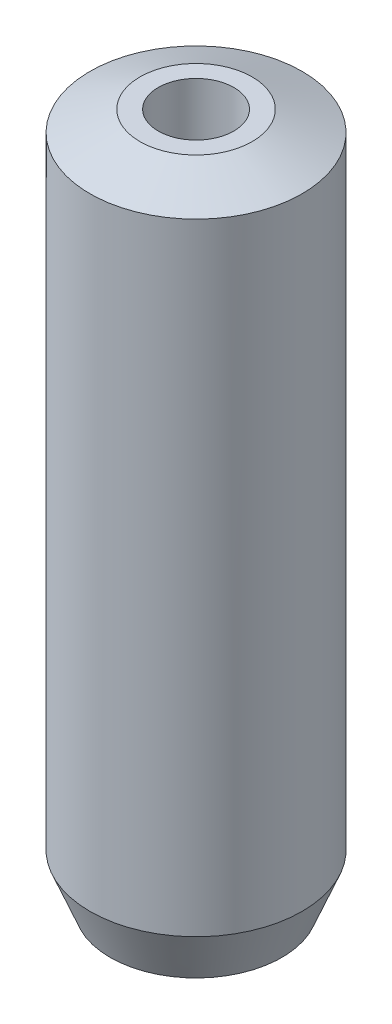
ISO-10303-21;
HEADER;
FILE_DESCRIPTION(('STEP AP214'),'2;1');
FILE_NAME('part.step','',(''),(''),'','','');
FILE_SCHEMA(('AUTOMOTIVE_DESIGN { 1 0 10303 214 1 1 1 1 }'));
ENDSEC;
DATA;
#1=APPLICATION_CONTEXT('core data for automotive mechanical design processes');
#2=APPLICATION_PROTOCOL_DEFINITION('international standard','automotive_design',2000,#1);
#3=PRODUCT_CONTEXT('',#1,'mechanical');
#4=PRODUCT('Part','Part','',(#3));
#5=PRODUCT_RELATED_PRODUCT_CATEGORY('part','',(#4));
#6=PRODUCT_DEFINITION_FORMATION('','',#4);
#7=PRODUCT_DEFINITION_CONTEXT('part definition',#1,'design');
#8=PRODUCT_DEFINITION('design','',#6,#7);
#9=PRODUCT_DEFINITION_SHAPE('','',#8);
#10=(LENGTH_UNIT() NAMED_UNIT(*) SI_UNIT(.MILLI.,.METRE.));
#11=(NAMED_UNIT(*) PLANE_ANGLE_UNIT() SI_UNIT($,.RADIAN.));
#12=(NAMED_UNIT(*) SI_UNIT($,.STERADIAN.) SOLID_ANGLE_UNIT());
#13=UNCERTAINTY_MEASURE_WITH_UNIT(LENGTH_MEASURE(1.E-05),#10,'distance_accuracy_value','');
#14=(GEOMETRIC_REPRESENTATION_CONTEXT(3) GLOBAL_UNCERTAINTY_ASSIGNED_CONTEXT((#13)) GLOBAL_UNIT_ASSIGNED_CONTEXT((#10,
#11,#12)) REPRESENTATION_CONTEXT('',''));
#15=CARTESIAN_POINT('',(0.,0.,0.));
#16=DIRECTION('',(0.,0.,1.));
#17=DIRECTION('',(1.,0.,0.));
#18=AXIS2_PLACEMENT_3D('',#15,#16,#17);
#19=CARTESIAN_POINT('',(0.,195.601865288086,0.));
#20=DIRECTION('',(0.,-1.,0.));
#21=DIRECTION('',(0.,0.,-1.));
#22=AXIS2_PLACEMENT_3D('',#19,#20,#21);
#23=CYLINDRICAL_SURFACE('',#22,30.);
#24=CARTESIAN_POINT('',(0.,189.899442802333,0.));
#25=DIRECTION('',(0.,1.,0.));
#26=DIRECTION('',(0.,0.,1.));
#27=AXIS2_PLACEMENT_3D('',#24,#25,#26);
#28=CIRCLE('',#27,30.);
#29=CARTESIAN_POINT('',(0.,189.899442802333,-30.));
#30=VERTEX_POINT('',#29);
#31=EDGE_CURVE('E50',#30,#30,#28,.F.);
#32=CARTESIAN_POINT('',(0.,14.1375035635513,0.));
#33=DIRECTION('',(0.,1.,0.));
#34=DIRECTION('',(0.,0.,1.));
#35=AXIS2_PLACEMENT_3D('',#32,#33,#34);
#36=CIRCLE('',#35,30.);
#37=CARTESIAN_POINT('',(0.,14.1375035635513,-30.));
#38=VERTEX_POINT('',#37);
#39=EDGE_CURVE('E51',#38,#38,#36,.T.);
#40=CARTESIAN_POINT('',(0.,189.899442802333,-30.));
#41=CARTESIAN_POINT('',(0.,188.068589268596,-30.));
#42=CARTESIAN_POINT('',(0.,186.237735734859,-30.));
#43=CARTESIAN_POINT('',(0.,182.576028667384,-30.));
#44=CARTESIAN_POINT('',(0.,180.745175133647,-30.));
#45=CARTESIAN_POINT('',(0.,177.083468066172,-30.));
#46=CARTESIAN_POINT('',(0.,175.252614532435,-30.));
#47=CARTESIAN_POINT('',(0.,171.59090746496,-30.));
#48=CARTESIAN_POINT('',(0.,169.760053931223,-30.));
#49=CARTESIAN_POINT('',(0.,166.098346863748,-30.));
#50=CARTESIAN_POINT('',(0.,164.267493330011,-30.));
#51=CARTESIAN_POINT('',(0.,160.605786262536,-30.));
#52=CARTESIAN_POINT('',(0.,158.774932728799,-30.));
#53=CARTESIAN_POINT('',(0.,155.113225661324,-30.));
#54=CARTESIAN_POINT('',(0.,153.282372127587,-30.));
#55=CARTESIAN_POINT('',(0.,149.620665060112,-30.));
#56=CARTESIAN_POINT('',(0.,147.789811526375,-30.));
#57=CARTESIAN_POINT('',(0.,144.1281044589,-30.));
#58=CARTESIAN_POINT('',(0.,142.297250925163,-30.));
#59=CARTESIAN_POINT('',(0.,138.635543857689,-30.));
#60=CARTESIAN_POINT('',(0.,136.804690323951,-30.));
#61=CARTESIAN_POINT('',(0.,133.142983256477,-30.));
#62=CARTESIAN_POINT('',(0.,131.312129722739,-30.));
#63=CARTESIAN_POINT('',(0.,127.650422655265,-30.));
#64=CARTESIAN_POINT('',(0.,125.819569121527,-30.));
#65=CARTESIAN_POINT('',(0.,122.157862054053,-30.));
#66=CARTESIAN_POINT('',(0.,120.327008520315,-30.));
#67=CARTESIAN_POINT('',(0.,116.665301452841,-30.));
#68=CARTESIAN_POINT('',(0.,114.834447919103,-30.));
#69=CARTESIAN_POINT('',(0.,111.172740851629,-30.));
#70=CARTESIAN_POINT('',(0.,109.341887317892,-30.));
#71=CARTESIAN_POINT('',(0.,105.680180250417,-30.));
#72=CARTESIAN_POINT('',(0.,103.84932671668,-30.));
#73=CARTESIAN_POINT('',(0.,100.187619649205,-30.));
#74=CARTESIAN_POINT('',(0.,98.3567661154677,-30.));
#75=CARTESIAN_POINT('',(0.,94.6950590479931,-30.));
#76=CARTESIAN_POINT('',(0.,92.8642055142557,-30.));
#77=CARTESIAN_POINT('',(0.,89.2024984467811,-30.));
#78=CARTESIAN_POINT('',(0.,87.3716449130438,-30.));
#79=CARTESIAN_POINT('',(0.,83.7099378455692,-30.));
#80=CARTESIAN_POINT('',(0.,81.8790843118318,-30.));
#81=CARTESIAN_POINT('',(0.,78.2173772443572,-30.));
#82=CARTESIAN_POINT('',(0.,76.3865237106199,-30.));
#83=CARTESIAN_POINT('',(0.,72.7248166431453,-30.));
#84=CARTESIAN_POINT('',(0.,70.893963109408,-30.));
#85=CARTESIAN_POINT('',(0.,67.2322560419334,-30.));
#86=CARTESIAN_POINT('',(0.,65.401402508196,-30.));
#87=CARTESIAN_POINT('',(0.,61.7396954407214,-30.));
#88=CARTESIAN_POINT('',(0.,59.9088419069841,-30.));
#89=CARTESIAN_POINT('',(0.,56.2471348395095,-30.));
#90=CARTESIAN_POINT('',(0.,54.4162813057722,-30.));
#91=CARTESIAN_POINT('',(0.,50.7545742382975,-30.));
#92=CARTESIAN_POINT('',(0.,48.9237207045602,-30.));
#93=CARTESIAN_POINT('',(0.,45.2620136370856,-30.));
#94=CARTESIAN_POINT('',(0.,43.4311601033483,-30.));
#95=CARTESIAN_POINT('',(0.,39.7694530358736,-30.));
#96=CARTESIAN_POINT('',(0.,37.9385995021363,-30.));
#97=CARTESIAN_POINT('',(0.,34.2768924346617,-30.));
#98=CARTESIAN_POINT('',(0.,32.4460389009244,-30.));
#99=CARTESIAN_POINT('',(0.,28.7843318334498,-30.));
#100=CARTESIAN_POINT('',(0.,26.9534782997124,-30.));
#101=CARTESIAN_POINT('',(0.,23.2917712322378,-30.));
#102=CARTESIAN_POINT('',(0.,21.4609176985005,-30.));
#103=CARTESIAN_POINT('',(0.,17.7992106310259,-30.));
#104=CARTESIAN_POINT('',(0.,15.9683570972886,-30.));
#105=CARTESIAN_POINT('',(0.,14.1375035635513,-30.));
#106=B_SPLINE_CURVE_WITH_KNOTS('',3,(#40,#41,#42,#43,#44,#45,#46,#47,#48,#49,#50,#51,#52,#53,
#54,#55,#56,#57,#58,#59,#60,#61,#62,#63,#64,#65,#66,#67,#68,#69,#70,#71,#72,#73,#74,#75,#76,#77,
#78,#79,#80,#81,#82,#83,#84,#85,#86,#87,#88,#89,#90,#91,#92,#93,#94,#95,#96,#97,#98,#99,#100,
#101,#102,#103,#104,#105),.UNSPECIFIED.,.F.,.F.,(4,2,2,2,2,2,2,2,2,2,2,2,2,2,2,2,2,2,2,2,2,2,2,
2,2,2,2,2,2,2,2,2,4),(0.,5.49256060121192,10.9851212024239,16.4776818036358,21.9702424048477,
27.4628030060597,32.9553636072716,38.4479242084836,43.9404848096955,49.4330454109075,
54.9256060121194,60.4181666133313,65.9107272145432,71.4032878157552,76.8958484169671,
82.3884090181791,87.880969619391,93.3735302206029,98.8660908218149,104.358651423027,
109.851212024239,115.343772625451,120.836333226663,126.328893827875,131.821454429087,
137.314015030298,142.80657563151,148.299136232722,153.791696833934,159.284257435146,
164.776818036358,170.26937863757,175.761939238782),.UNSPECIFIED.);
#107=EDGE_CURVE('BSEAM39',#30,#38,#106,.T.);
#108=ORIENTED_EDGE('',*,*,#31,.T.);
#109=ORIENTED_EDGE('',*,*,#39,.T.);
#110=ORIENTED_EDGE('',*,*,#107,.T.);
#111=ORIENTED_EDGE('',*,*,#107,.F.);
#112=EDGE_LOOP('',(#108,#110,#109,#111));
#113=FACE_BOUND('',#112,.T.);
#114=ADVANCED_FACE('F39',(#113),#23,.T.);
#115=CARTESIAN_POINT('',(0.,195.601865288086,0.));
#116=DIRECTION('',(0.,1.,0.));
#117=DIRECTION('',(0.,0.,1.));
#118=AXIS2_PLACEMENT_3D('',#115,#116,#117);
#119=PLANE('',#118);
#120=CARTESIAN_POINT('',(0.,195.601865288086,0.));
#121=DIRECTION('',(0.,1.,0.));
#122=DIRECTION('',(0.,0.,1.));
#123=AXIS2_PLACEMENT_3D('',#120,#121,#122);
#124=CIRCLE('',#123,15.8624964364492);
#125=CARTESIAN_POINT('',(0.,195.601865288086,15.8624964364492));
#126=VERTEX_POINT('',#125);
#127=EDGE_CURVE('E54',#126,#126,#124,.T.);
#128=ORIENTED_EDGE('',*,*,#127,.T.);
#129=EDGE_LOOP('',(#128));
#130=FACE_BOUND('',#129,.T.);
#131=CARTESIAN_POINT('',(0.,195.601865288086,0.));
#132=DIRECTION('',(0.,1.,0.));
#133=DIRECTION('',(0.,0.,1.));
#134=AXIS2_PLACEMENT_3D('',#131,#132,#133);
#135=CIRCLE('',#134,10.6923880368058);
#136=CARTESIAN_POINT('',(0.,195.601865288086,-10.6923880368058));
#137=VERTEX_POINT('',#136);
#138=EDGE_CURVE('E58',#137,#137,#135,.T.);
#139=ORIENTED_EDGE('',*,*,#138,.F.);
#140=EDGE_LOOP('',(#139));
#141=FACE_BOUND('',#140,.T.);
#142=ADVANCED_FACE('F69',(#130,#141),#119,.T.);
#143=CARTESIAN_POINT('',(0.,0.,0.));
#144=DIRECTION('',(0.,1.,0.));
#145=DIRECTION('',(0.,0.,1.));
#146=AXIS2_PLACEMENT_3D('',#143,#144,#145);
#147=PLANE('',#146);
#148=CARTESIAN_POINT('',(0.,0.,0.));
#149=DIRECTION('',(0.,1.,0.));
#150=DIRECTION('',(0.,0.,1.));
#151=AXIS2_PLACEMENT_3D('',#148,#149,#150);
#152=CIRCLE('',#151,24.2975775142471);
#153=CARTESIAN_POINT('',(0.,0.,24.2975775142471));
#154=VERTEX_POINT('',#153);
#155=EDGE_CURVE('E10',#154,#154,#152,.F.);
#156=ORIENTED_EDGE('',*,*,#155,.T.);
#157=EDGE_LOOP('',(#156));
#158=FACE_BOUND('',#157,.T.);
#159=CARTESIAN_POINT('',(0.,0.,0.));
#160=DIRECTION('',(0.,1.,0.));
#161=DIRECTION('',(0.,0.,1.));
#162=AXIS2_PLACEMENT_3D('',#159,#160,#161);
#163=CIRCLE('',#162,10.6923880368058);
#164=CARTESIAN_POINT('',(0.,0.,-10.6923880368058));
#165=VERTEX_POINT('',#164);
#166=EDGE_CURVE('E63',#165,#165,#163,.T.);
#167=ORIENTED_EDGE('',*,*,#166,.T.);
#168=EDGE_LOOP('',(#167));
#169=FACE_BOUND('',#168,.T.);
#170=ADVANCED_FACE('F75',(#158,#169),#147,.F.);
#171=CARTESIAN_POINT('',(0.,195.601865288086,0.));
#172=DIRECTION('',(0.,-1.,0.));
#173=DIRECTION('',(0.,0.,-1.));
#174=AXIS2_PLACEMENT_3D('',#171,#172,#173);
#175=CYLINDRICAL_SURFACE('',#174,10.6923880368058);
#176=CARTESIAN_POINT('',(0.,195.601865288086,-10.6923880368058));
#177=CARTESIAN_POINT('',(0.,193.564345858002,-10.6923880368058));
#178=CARTESIAN_POINT('',(0.,191.526826427918,-10.6923880368058));
#179=CARTESIAN_POINT('',(0.,187.451787567749,-10.6923880368058));
#180=CARTESIAN_POINT('',(0.,185.414268137665,-10.6923880368058));
#181=CARTESIAN_POINT('',(0.,181.339229277496,-10.6923880368058));
#182=CARTESIAN_POINT('',(0.,179.301709847412,-10.6923880368058));
#183=CARTESIAN_POINT('',(0.,175.226670987244,-10.6923880368058));
#184=CARTESIAN_POINT('',(0.,173.189151557159,-10.6923880368058));
#185=CARTESIAN_POINT('',(0.,169.114112696991,-10.6923880368058));
#186=CARTESIAN_POINT('',(0.,167.076593266907,-10.6923880368058));
#187=CARTESIAN_POINT('',(0.,163.001554406738,-10.6923880368058));
#188=CARTESIAN_POINT('',(0.,160.964034976654,-10.6923880368058));
#189=CARTESIAN_POINT('',(0.,156.888996116486,-10.6923880368058));
#190=CARTESIAN_POINT('',(0.,154.851476686401,-10.6923880368058));
#191=CARTESIAN_POINT('',(0.,150.776437826233,-10.6923880368058));
#192=CARTESIAN_POINT('',(0.,148.738918396149,-10.6923880368058));
#193=CARTESIAN_POINT('',(0.,144.66387953598,-10.6923880368058));
#194=CARTESIAN_POINT('',(0.,142.626360105896,-10.6923880368058));
#195=CARTESIAN_POINT('',(0.,138.551321245728,-10.6923880368058));
#196=CARTESIAN_POINT('',(0.,136.513801815643,-10.6923880368058));
#197=CARTESIAN_POINT('',(0.,132.438762955475,-10.6923880368058));
#198=CARTESIAN_POINT('',(0.,130.401243525391,-10.6923880368058));
#199=CARTESIAN_POINT('',(0.,126.326204665222,-10.6923880368058));
#200=CARTESIAN_POINT('',(0.,124.288685235138,-10.6923880368058));
#201=CARTESIAN_POINT('',(0.,120.21364637497,-10.6923880368058));
#202=CARTESIAN_POINT('',(0.,118.176126944885,-10.6923880368058));
#203=CARTESIAN_POINT('',(0.,114.101088084717,-10.6923880368058));
#204=CARTESIAN_POINT('',(0.,112.063568654633,-10.6923880368058));
#205=CARTESIAN_POINT('',(0.,107.988529794464,-10.6923880368058));
#206=CARTESIAN_POINT('',(0.,105.95101036438,-10.6923880368058));
#207=CARTESIAN_POINT('',(0.,101.875971504211,-10.6923880368058));
#208=CARTESIAN_POINT('',(0.,99.8384520741272,-10.6923880368058));
#209=CARTESIAN_POINT('',(0.,95.7634132139588,-10.6923880368058));
#210=CARTESIAN_POINT('',(0.,93.7258937838746,-10.6923880368058));
#211=CARTESIAN_POINT('',(0.,89.6508549237061,-10.6923880368058));
#212=CARTESIAN_POINT('',(0.,87.6133354936219,-10.6923880368058));
#213=CARTESIAN_POINT('',(0.,83.5382966334534,-10.6923880368058));
#214=CARTESIAN_POINT('',(0.,81.5007772033692,-10.6923880368058));
#215=CARTESIAN_POINT('',(0.,77.4257383432007,-10.6923880368058));
#216=CARTESIAN_POINT('',(0.,75.3882189131165,-10.6923880368058));
#217=CARTESIAN_POINT('',(0.,71.313180052948,-10.6923880368058));
#218=CARTESIAN_POINT('',(0.,69.2756606228638,-10.6923880368058));
#219=CARTESIAN_POINT('',(0.,65.2006217626953,-10.6923880368058));
#220=CARTESIAN_POINT('',(0.,63.1631023326111,-10.6923880368058));
#221=CARTESIAN_POINT('',(0.,59.0880634724426,-10.6923880368058));
#222=CARTESIAN_POINT('',(0.,57.0505440423584,-10.6923880368058));
#223=CARTESIAN_POINT('',(0.,52.97550518219,-10.6923880368058));
#224=CARTESIAN_POINT('',(0.,50.9379857521057,-10.6923880368058));
#225=CARTESIAN_POINT('',(0.,46.8629468919373,-10.6923880368058));
#226=CARTESIAN_POINT('',(0.,44.8254274618531,-10.6923880368058));
#227=CARTESIAN_POINT('',(0.,40.7503886016846,-10.6923880368058));
#228=CARTESIAN_POINT('',(0.,38.7128691716004,-10.6923880368058));
#229=CARTESIAN_POINT('',(0.,34.6378303114319,-10.6923880368058));
#230=CARTESIAN_POINT('',(0.,32.6003108813477,-10.6923880368058));
#231=CARTESIAN_POINT('',(0.,28.5252720211792,-10.6923880368058));
#232=CARTESIAN_POINT('',(0.,26.487752591095,-10.6923880368058));
#233=CARTESIAN_POINT('',(0.,22.4127137309265,-10.6923880368058));
#234=CARTESIAN_POINT('',(0.,20.3751943008423,-10.6923880368058));
#235=CARTESIAN_POINT('',(0.,16.3001554406738,-10.6923880368058));
#236=CARTESIAN_POINT('',(0.,14.2626360105896,-10.6923880368058));
#237=CARTESIAN_POINT('',(0.,10.1875971504212,-10.6923880368058));
#238=CARTESIAN_POINT('',(0.,8.15007772033693,-10.6923880368058));
#239=CARTESIAN_POINT('',(0.,4.07503886016847,-10.6923880368058));
#240=CARTESIAN_POINT('',(0.,2.03751943008423,-10.6923880368058));
#241=CARTESIAN_POINT('',(0.,0.,-10.6923880368058));
#242=B_SPLINE_CURVE_WITH_KNOTS('',3,(#176,#177,#178,#179,#180,#181,#182,#183,#184,#185,#186,
#187,#188,#189,#190,#191,#192,#193,#194,#195,#196,#197,#198,#199,#200,#201,#202,#203,#204,#205,
#206,#207,#208,#209,#210,#211,#212,#213,#214,#215,#216,#217,#218,#219,#220,#221,#222,#223,#224,
#225,#226,#227,#228,#229,#230,#231,#232,#233,#234,#235,#236,#237,#238,#239,#240,#241),
.UNSPECIFIED.,.F.,.F.,(4,2,2,2,2,2,2,2,2,2,2,2,2,2,2,2,2,2,2,2,2,2,2,2,2,2,2,2,2,2,2,2,4),(0.,
6.11255829025267,12.2251165805053,18.337674870758,24.4502331610107,30.5627914512634,
36.6753497415161,42.7879080317688,48.9004663220215,55.0130246122742,61.1255829025268,
67.2381411927795,73.3506994830322,79.4632577732849,85.5758160635376,91.6883743537903,
97.800932644043,103.913490934296,110.026049224548,116.138607514801,122.251165805054,
128.363724095306,134.476282385559,140.588840675812,146.701398966064,152.813957256317,
158.92651554657,165.039073836823,171.151632127075,177.264190417328,183.376748707581,
189.489306997833,195.601865288086),.UNSPECIFIED.);
#243=EDGE_CURVE('BSEAM70',#137,#165,#242,.T.);
#244=ORIENTED_EDGE('',*,*,#138,.T.);
#245=ORIENTED_EDGE('',*,*,#166,.F.);
#246=ORIENTED_EDGE('',*,*,#243,.T.);
#247=ORIENTED_EDGE('',*,*,#243,.F.);
#248=EDGE_LOOP('',(#244,#246,#245,#247));
#249=FACE_BOUND('',#248,.T.);
#250=ADVANCED_FACE('F70',(#249),#175,.F.);
#251=CARTESIAN_POINT('',(0.,195.601865288086,0.));
#252=DIRECTION('',(0.,-1.,0.));
#253=DIRECTION('',(0.,0.,-1.));
#254=AXIS2_PLACEMENT_3D('',#251,#252,#253);
#255=CONICAL_SURFACE('',#254,15.8624964364492,1.1874016829268);
#256=ORIENTED_EDGE('',*,*,#31,.F.);
#257=EDGE_LOOP('',(#256));
#258=FACE_BOUND('',#257,.T.);
#259=ORIENTED_EDGE('',*,*,#127,.F.);
#260=EDGE_LOOP('',(#259));
#261=FACE_BOUND('',#260,.T.);
#262=ADVANCED_FACE('F81',(#258,#261),#255,.T.);
#263=CARTESIAN_POINT('',(0.,14.1375035635513,0.));
#264=DIRECTION('',(0.,1.,0.));
#265=DIRECTION('',(0.,0.,1.));
#266=AXIS2_PLACEMENT_3D('',#263,#264,#265);
#267=CONICAL_SURFACE('',#266,30.,0.383394643868099);
#268=ORIENTED_EDGE('',*,*,#155,.F.);
#269=EDGE_LOOP('',(#268));
#270=FACE_BOUND('',#269,.T.);
#271=ORIENTED_EDGE('',*,*,#39,.F.);
#272=EDGE_LOOP('',(#271));
#273=FACE_BOUND('',#272,.T.);
#274=ADVANCED_FACE('F45',(#270,#273),#267,.T.);
#275=CLOSED_SHELL('',(#114,#142,#170,#250,#262,#274));
#276=MANIFOLD_SOLID_BREP('B2',#275);
#277=ADVANCED_BREP_SHAPE_REPRESENTATION('',(#18,#276),#14);
#278=SHAPE_DEFINITION_REPRESENTATION(#9,#277);
ENDSEC;
END-ISO-10303-21;
